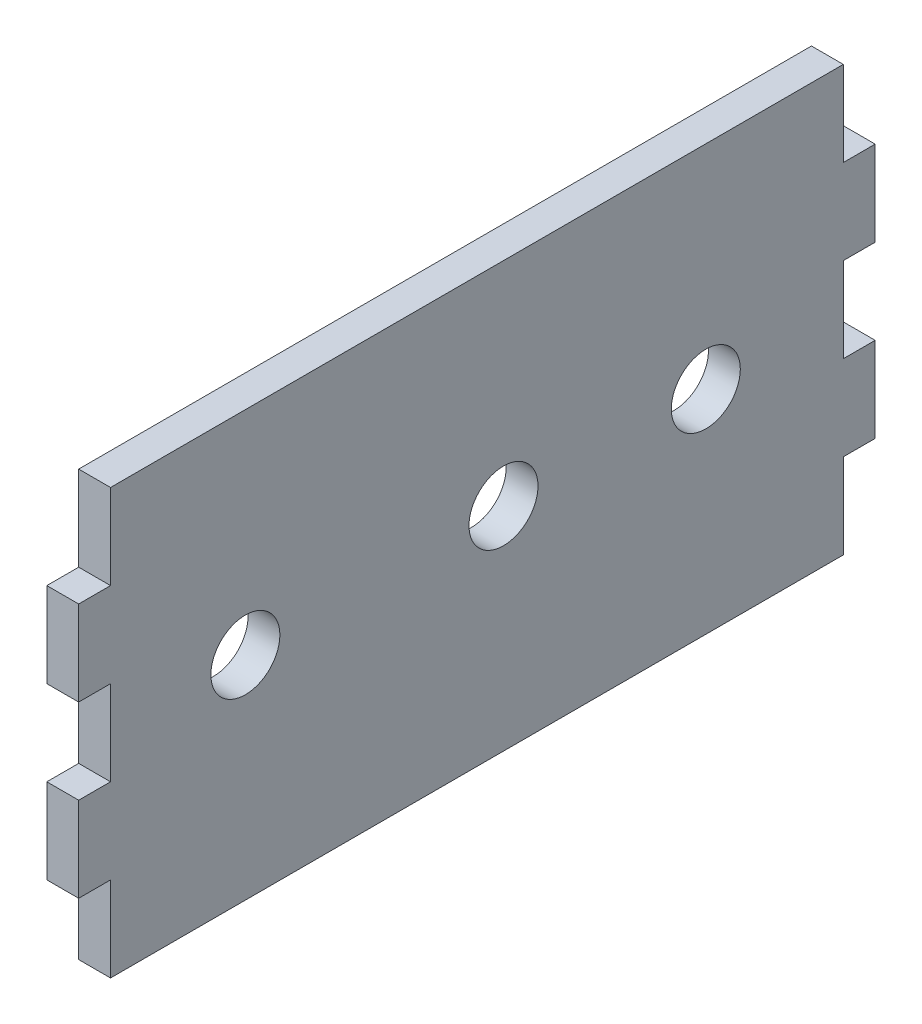
ISO-10303-21;
HEADER;
FILE_DESCRIPTION(('STEP AP214'),'2;1');
FILE_NAME('part.step','',(''),(''),'','','');
FILE_SCHEMA(('AUTOMOTIVE_DESIGN { 1 0 10303 214 1 1 1 1 }'));
ENDSEC;
DATA;
#1=APPLICATION_CONTEXT('core data for automotive mechanical design processes');
#2=APPLICATION_PROTOCOL_DEFINITION('international standard','automotive_design',2000,#1);
#3=PRODUCT_CONTEXT('',#1,'mechanical');
#4=PRODUCT('Part','Part','',(#3));
#5=PRODUCT_RELATED_PRODUCT_CATEGORY('part','',(#4));
#6=PRODUCT_DEFINITION_FORMATION('','',#4);
#7=PRODUCT_DEFINITION_CONTEXT('part definition',#1,'design');
#8=PRODUCT_DEFINITION('design','',#6,#7);
#9=PRODUCT_DEFINITION_SHAPE('','',#8);
#10=(LENGTH_UNIT() NAMED_UNIT(*) SI_UNIT(.MILLI.,.METRE.));
#11=(NAMED_UNIT(*) PLANE_ANGLE_UNIT() SI_UNIT($,.RADIAN.));
#12=(NAMED_UNIT(*) SI_UNIT($,.STERADIAN.) SOLID_ANGLE_UNIT());
#13=UNCERTAINTY_MEASURE_WITH_UNIT(LENGTH_MEASURE(1.E-05),#10,'distance_accuracy_value','');
#14=(GEOMETRIC_REPRESENTATION_CONTEXT(3) GLOBAL_UNCERTAINTY_ASSIGNED_CONTEXT((#13)) GLOBAL_UNIT_ASSIGNED_CONTEXT((#10,
#11,#12)) REPRESENTATION_CONTEXT('',''));
#15=CARTESIAN_POINT('',(0.,0.,0.));
#16=DIRECTION('',(0.,0.,1.));
#17=DIRECTION('',(1.,0.,0.));
#18=AXIS2_PLACEMENT_3D('',#15,#16,#17);
#19=CARTESIAN_POINT('',(6.,-40.0000000000001,75.));
#20=DIRECTION('',(0.,0.,-1.));
#21=DIRECTION('',(-1.,0.,0.));
#22=AXIS2_PLACEMENT_3D('',#19,#20,#21);
#23=PLANE('',#22);
#24=DIRECTION('',(0.,-1.,0.));
#25=VECTOR('',#24,1.);
#26=CARTESIAN_POINT('',(0.,-40.0000000000001,75.));
#27=LINE('',#26,#25);
#28=CARTESIAN_POINT('',(0.,23.9999999999999,75.));
#29=VERTEX_POINT('',#28);
#30=CARTESIAN_POINT('',(0.,7.99999999999999,75.));
#31=VERTEX_POINT('',#30);
#32=EDGE_CURVE('E205',#29,#31,#27,.T.);
#33=ORIENTED_EDGE('',*,*,#32,.T.);
#34=DIRECTION('',(1.,0.,0.));
#35=VECTOR('',#34,1.);
#36=CARTESIAN_POINT('',(0.,7.99999999999999,75.));
#37=LINE('',#36,#35);
#38=CARTESIAN_POINT('',(6.,7.99999999999999,75.));
#39=VERTEX_POINT('',#38);
#40=EDGE_CURVE('E263',#31,#39,#37,.T.);
#41=ORIENTED_EDGE('',*,*,#40,.T.);
#42=DIRECTION('',(0.,-1.,0.));
#43=VECTOR('',#42,1.);
#44=CARTESIAN_POINT('',(6.,-40.0000000000001,75.));
#45=LINE('',#44,#43);
#46=CARTESIAN_POINT('',(6.,23.9999999999999,75.));
#47=VERTEX_POINT('',#46);
#48=EDGE_CURVE('E216',#47,#39,#45,.T.);
#49=ORIENTED_EDGE('',*,*,#48,.F.);
#50=DIRECTION('',(1.,0.,0.));
#51=VECTOR('',#50,1.);
#52=CARTESIAN_POINT('',(0.,23.9999999999999,75.));
#53=LINE('',#52,#51);
#54=EDGE_CURVE('E238',#29,#47,#53,.T.);
#55=ORIENTED_EDGE('',*,*,#54,.F.);
#56=EDGE_LOOP('',(#33,#41,#49,#55));
#57=FACE_BOUND('',#56,.T.);
#58=ADVANCED_FACE('F34',(#57),#23,.F.);
#59=CARTESIAN_POINT('',(6.,-40.,-75.));
#60=DIRECTION('',(0.,0.,1.));
#61=DIRECTION('',(0.,-1.,0.));
#62=AXIS2_PLACEMENT_3D('',#59,#60,#61);
#63=PLANE('',#62);
#64=DIRECTION('',(0.,1.,0.));
#65=VECTOR('',#64,1.);
#66=CARTESIAN_POINT('',(6.,-40.,-75.));
#67=LINE('',#66,#65);
#68=CARTESIAN_POINT('',(6.,-24.,-75.));
#69=VERTEX_POINT('',#68);
#70=CARTESIAN_POINT('',(6.,-7.99999999999998,-75.));
#71=VERTEX_POINT('',#70);
#72=EDGE_CURVE('E43',#69,#71,#67,.T.);
#73=ORIENTED_EDGE('',*,*,#72,.F.);
#74=DIRECTION('',(1.,0.,0.));
#75=VECTOR('',#74,1.);
#76=CARTESIAN_POINT('',(0.,-24.,-75.));
#77=LINE('',#76,#75);
#78=CARTESIAN_POINT('',(0.,-24.,-75.));
#79=VERTEX_POINT('',#78);
#80=EDGE_CURVE('E298',#79,#69,#77,.T.);
#81=ORIENTED_EDGE('',*,*,#80,.F.);
#82=DIRECTION('',(0.,1.,0.));
#83=VECTOR('',#82,1.);
#84=CARTESIAN_POINT('',(0.,-40.,-75.));
#85=LINE('',#84,#83);
#86=CARTESIAN_POINT('',(0.,-7.99999999999998,-75.));
#87=VERTEX_POINT('',#86);
#88=EDGE_CURVE('E201',#79,#87,#85,.T.);
#89=ORIENTED_EDGE('',*,*,#88,.T.);
#90=DIRECTION('',(1.,0.,0.));
#91=VECTOR('',#90,1.);
#92=CARTESIAN_POINT('',(0.,-7.99999999999998,-75.));
#93=LINE('',#92,#91);
#94=EDGE_CURVE('E276',#87,#71,#93,.T.);
#95=ORIENTED_EDGE('',*,*,#94,.T.);
#96=EDGE_LOOP('',(#73,#81,#89,#95));
#97=FACE_BOUND('',#96,.T.);
#98=ADVANCED_FACE('F351',(#97),#63,.F.);
#99=CARTESIAN_POINT('',(0.,-8.00000000000001,75.));
#100=VERTEX_POINT('',#99);
#101=CARTESIAN_POINT('',(0.,-24.0000000000001,74.9999999999999));
#102=VERTEX_POINT('',#101);
#103=EDGE_CURVE('E208',#100,#102,#27,.T.);
#104=ORIENTED_EDGE('',*,*,#103,.T.);
#105=DIRECTION('',(1.,0.,0.));
#106=VECTOR('',#105,1.);
#107=CARTESIAN_POINT('',(0.,-24.0000000000001,74.9999999999999));
#108=LINE('',#107,#106);
#109=CARTESIAN_POINT('',(6.,-24.0000000000001,74.9999999999999));
#110=VERTEX_POINT('',#109);
#111=EDGE_CURVE('E251',#102,#110,#108,.T.);
#112=ORIENTED_EDGE('',*,*,#111,.T.);
#113=CARTESIAN_POINT('',(6.,-8.00000000000001,75.));
#114=VERTEX_POINT('',#113);
#115=EDGE_CURVE('E217',#114,#110,#45,.T.);
#116=ORIENTED_EDGE('',*,*,#115,.F.);
#117=DIRECTION('',(1.,0.,0.));
#118=VECTOR('',#117,1.);
#119=CARTESIAN_POINT('',(0.,-8.00000000000001,75.));
#120=LINE('',#119,#118);
#121=EDGE_CURVE('E256',#100,#114,#120,.T.);
#122=ORIENTED_EDGE('',*,*,#121,.F.);
#123=EDGE_LOOP('',(#104,#112,#116,#122));
#124=FACE_BOUND('',#123,.T.);
#125=ADVANCED_FACE('F36',(#124),#23,.F.);
#126=CARTESIAN_POINT('',(6.,-40.,-75.));
#127=DIRECTION('',(0.,1.,0.));
#128=DIRECTION('',(0.,0.,1.));
#129=AXIS2_PLACEMENT_3D('',#126,#127,#128);
#130=PLANE('',#129);
#131=DIRECTION('',(0.,0.,-1.));
#132=VECTOR('',#131,1.);
#133=CARTESIAN_POINT('',(6.,-40.,-75.));
#134=LINE('',#133,#132);
#135=CARTESIAN_POINT('',(6.,-40.0000000000001,68.9999999999999));
#136=VERTEX_POINT('',#135);
#137=CARTESIAN_POINT('',(6.,-40.,-68.9999999999999));
#138=VERTEX_POINT('',#137);
#139=EDGE_CURVE('E213',#136,#138,#134,.T.);
#140=ORIENTED_EDGE('',*,*,#139,.F.);
#141=DIRECTION('',(1.,0.,0.));
#142=VECTOR('',#141,1.);
#143=CARTESIAN_POINT('',(0.,-40.0000000000001,68.9999999999999));
#144=LINE('',#143,#142);
#145=CARTESIAN_POINT('',(0.,-40.0000000000001,68.9999999999999));
#146=VERTEX_POINT('',#145);
#147=EDGE_CURVE('E314',#146,#136,#144,.T.);
#148=ORIENTED_EDGE('',*,*,#147,.F.);
#149=DIRECTION('',(0.,0.,-1.));
#150=VECTOR('',#149,1.);
#151=CARTESIAN_POINT('',(0.,-40.,-75.));
#152=LINE('',#151,#150);
#153=CARTESIAN_POINT('',(0.,-40.,-68.9999999999999));
#154=VERTEX_POINT('',#153);
#155=EDGE_CURVE('E202',#146,#154,#152,.T.);
#156=ORIENTED_EDGE('',*,*,#155,.T.);
#157=DIRECTION('',(1.,0.,0.));
#158=VECTOR('',#157,1.);
#159=CARTESIAN_POINT('',(0.,-40.,-68.9999999999999));
#160=LINE('',#159,#158);
#161=EDGE_CURVE('E302',#154,#138,#160,.T.);
#162=ORIENTED_EDGE('',*,*,#161,.T.);
#163=EDGE_LOOP('',(#140,#148,#156,#162));
#164=FACE_BOUND('',#163,.T.);
#165=ADVANCED_FACE('F365',(#164),#130,.F.);
#166=CARTESIAN_POINT('',(0.,8.00000000000002,-75.));
#167=VERTEX_POINT('',#166);
#168=CARTESIAN_POINT('',(0.,24.,-75.));
#169=VERTEX_POINT('',#168);
#170=EDGE_CURVE('E191',#167,#169,#85,.T.);
#171=ORIENTED_EDGE('',*,*,#170,.T.);
#172=DIRECTION('',(1.,0.,0.));
#173=VECTOR('',#172,1.);
#174=CARTESIAN_POINT('',(0.,24.,-75.));
#175=LINE('',#174,#173);
#176=CARTESIAN_POINT('',(6.,24.,-75.));
#177=VERTEX_POINT('',#176);
#178=EDGE_CURVE('E288',#169,#177,#175,.T.);
#179=ORIENTED_EDGE('',*,*,#178,.T.);
#180=CARTESIAN_POINT('',(6.,8.00000000000002,-75.));
#181=VERTEX_POINT('',#180);
#182=EDGE_CURVE('E193',#181,#177,#67,.T.);
#183=ORIENTED_EDGE('',*,*,#182,.F.);
#184=DIRECTION('',(1.,0.,0.));
#185=VECTOR('',#184,1.);
#186=CARTESIAN_POINT('',(0.,8.00000000000002,-75.));
#187=LINE('',#186,#185);
#188=EDGE_CURVE('E177',#167,#181,#187,.T.);
#189=ORIENTED_EDGE('',*,*,#188,.F.);
#190=EDGE_LOOP('',(#171,#179,#183,#189));
#191=FACE_BOUND('',#190,.T.);
#192=ADVANCED_FACE('F189',(#191),#63,.F.);
#193=CARTESIAN_POINT('',(6.,39.9999999999999,-75.));
#194=DIRECTION('',(0.,-1.,0.));
#195=DIRECTION('',(0.,0.,-1.));
#196=AXIS2_PLACEMENT_3D('',#193,#194,#195);
#197=PLANE('',#196);
#198=DIRECTION('',(0.,0.,1.));
#199=VECTOR('',#198,1.);
#200=CARTESIAN_POINT('',(6.,39.9999999999999,-75.));
#201=LINE('',#200,#199);
#202=CARTESIAN_POINT('',(6.,40.,-69.));
#203=VERTEX_POINT('',#202);
#204=CARTESIAN_POINT('',(6.,39.9999999999999,69.));
#205=VERTEX_POINT('',#204);
#206=EDGE_CURVE('E11',#203,#205,#201,.T.);
#207=ORIENTED_EDGE('',*,*,#206,.F.);
#208=DIRECTION('',(1.,0.,0.));
#209=VECTOR('',#208,1.);
#210=CARTESIAN_POINT('',(0.,40.,-69.));
#211=LINE('',#210,#209);
#212=CARTESIAN_POINT('',(0.,40.,-69.));
#213=VERTEX_POINT('',#212);
#214=EDGE_CURVE('E284',#213,#203,#211,.T.);
#215=ORIENTED_EDGE('',*,*,#214,.F.);
#216=DIRECTION('',(0.,0.,1.));
#217=VECTOR('',#216,1.);
#218=CARTESIAN_POINT('',(0.,39.9999999999999,-75.));
#219=LINE('',#218,#217);
#220=CARTESIAN_POINT('',(0.,39.9999999999999,69.));
#221=VERTEX_POINT('',#220);
#222=EDGE_CURVE('E38',#213,#221,#219,.T.);
#223=ORIENTED_EDGE('',*,*,#222,.T.);
#224=DIRECTION('',(1.,0.,0.));
#225=VECTOR('',#224,1.);
#226=CARTESIAN_POINT('',(0.,39.9999999999999,69.));
#227=LINE('',#226,#225);
#228=EDGE_CURVE('E224',#221,#205,#227,.T.);
#229=ORIENTED_EDGE('',*,*,#228,.T.);
#230=EDGE_LOOP('',(#207,#215,#223,#229));
#231=FACE_BOUND('',#230,.T.);
#232=ADVANCED_FACE('F402',(#231),#197,.F.);
#233=CARTESIAN_POINT('',(6.,0.,0.));
#234=DIRECTION('',(1.,0.,0.));
#235=DIRECTION('',(0.,0.,-1.));
#236=AXIS2_PLACEMENT_3D('',#233,#234,#235);
#237=PLANE('',#236);
#238=DIRECTION('',(0.,0.,1.));
#239=VECTOR('',#238,1.);
#240=CARTESIAN_POINT('',(6.,-24.0000000000001,74.9999999999999));
#241=LINE('',#240,#239);
#242=CARTESIAN_POINT('',(6.,-24.0000000000001,68.9999999999999));
#243=VERTEX_POINT('',#242);
#244=EDGE_CURVE('E320',#243,#110,#241,.T.);
#245=ORIENTED_EDGE('',*,*,#244,.F.);
#246=DIRECTION('',(0.,1.,0.));
#247=VECTOR('',#246,1.);
#248=CARTESIAN_POINT('',(6.,-40.0000000000001,68.9999999999999));
#249=LINE('',#248,#247);
#250=EDGE_CURVE('E305',#136,#243,#249,.T.);
#251=ORIENTED_EDGE('',*,*,#250,.F.);
#252=ORIENTED_EDGE('',*,*,#139,.T.);
#253=DIRECTION('',(0.,-1.,0.));
#254=VECTOR('',#253,1.);
#255=CARTESIAN_POINT('',(6.,-40.,-68.9999999999999));
#256=LINE('',#255,#254);
#257=CARTESIAN_POINT('',(6.,-24.,-69.));
#258=VERTEX_POINT('',#257);
#259=EDGE_CURVE('E306',#258,#138,#256,.T.);
#260=ORIENTED_EDGE('',*,*,#259,.F.);
#261=DIRECTION('',(0.,0.,1.));
#262=VECTOR('',#261,1.);
#263=CARTESIAN_POINT('',(6.,-24.,-75.));
#264=LINE('',#263,#262);
#265=EDGE_CURVE('E290',#69,#258,#264,.T.);
#266=ORIENTED_EDGE('',*,*,#265,.F.);
#267=ORIENTED_EDGE('',*,*,#72,.T.);
#268=DIRECTION('',(0.,0.,-1.));
#269=VECTOR('',#268,1.);
#270=CARTESIAN_POINT('',(6.,-7.99999999999998,-75.));
#271=LINE('',#270,#269);
#272=CARTESIAN_POINT('',(6.,-7.99999999999998,-69.));
#273=VERTEX_POINT('',#272);
#274=EDGE_CURVE('E184',#273,#71,#271,.T.);
#275=ORIENTED_EDGE('',*,*,#274,.F.);
#276=DIRECTION('',(0.,-1.,0.));
#277=VECTOR('',#276,1.);
#278=CARTESIAN_POINT('',(6.,8.00000000000002,-68.9999999999999));
#279=LINE('',#278,#277);
#280=CARTESIAN_POINT('',(6.,8.00000000000002,-68.9999999999999));
#281=VERTEX_POINT('',#280);
#282=EDGE_CURVE('E333',#281,#273,#279,.T.);
#283=ORIENTED_EDGE('',*,*,#282,.F.);
#284=DIRECTION('',(0.,0.,1.));
#285=VECTOR('',#284,1.);
#286=CARTESIAN_POINT('',(6.,8.00000000000002,-75.));
#287=LINE('',#286,#285);
#288=EDGE_CURVE('E336',#181,#281,#287,.T.);
#289=ORIENTED_EDGE('',*,*,#288,.F.);
#290=ORIENTED_EDGE('',*,*,#182,.T.);
#291=DIRECTION('',(0.,0.,-1.));
#292=VECTOR('',#291,1.);
#293=CARTESIAN_POINT('',(6.,24.,-75.));
#294=LINE('',#293,#292);
#295=CARTESIAN_POINT('',(6.,24.,-69.));
#296=VERTEX_POINT('',#295);
#297=EDGE_CURVE('E291',#296,#177,#294,.T.);
#298=ORIENTED_EDGE('',*,*,#297,.F.);
#299=DIRECTION('',(0.,-1.,0.));
#300=VECTOR('',#299,1.);
#301=CARTESIAN_POINT('',(6.,40.,-69.));
#302=LINE('',#301,#300);
#303=EDGE_CURVE('E266',#203,#296,#302,.T.);
#304=ORIENTED_EDGE('',*,*,#303,.F.);
#305=ORIENTED_EDGE('',*,*,#206,.T.);
#306=DIRECTION('',(0.,1.,0.));
#307=VECTOR('',#306,1.);
#308=CARTESIAN_POINT('',(6.,39.9999999999999,69.));
#309=LINE('',#308,#307);
#310=CARTESIAN_POINT('',(6.,23.9999999999999,69.));
#311=VERTEX_POINT('',#310);
#312=EDGE_CURVE('E245',#311,#205,#309,.T.);
#313=ORIENTED_EDGE('',*,*,#312,.F.);
#314=DIRECTION('',(0.,0.,-1.));
#315=VECTOR('',#314,1.);
#316=CARTESIAN_POINT('',(6.,23.9999999999999,75.));
#317=LINE('',#316,#315);
#318=EDGE_CURVE('E248',#47,#311,#317,.T.);
#319=ORIENTED_EDGE('',*,*,#318,.F.);
#320=ORIENTED_EDGE('',*,*,#48,.T.);
#321=DIRECTION('',(0.,0.,1.));
#322=VECTOR('',#321,1.);
#323=CARTESIAN_POINT('',(6.,7.99999999999999,75.));
#324=LINE('',#323,#322);
#325=CARTESIAN_POINT('',(6.,7.99999999999999,68.9999999999999));
#326=VERTEX_POINT('',#325);
#327=EDGE_CURVE('E267',#326,#39,#324,.T.);
#328=ORIENTED_EDGE('',*,*,#327,.F.);
#329=DIRECTION('',(0.,1.,0.));
#330=VECTOR('',#329,1.);
#331=CARTESIAN_POINT('',(6.,7.99999999999999,68.9999999999999));
#332=LINE('',#331,#330);
#333=CARTESIAN_POINT('',(6.,-8.00000000000001,68.9999999999999));
#334=VERTEX_POINT('',#333);
#335=EDGE_CURVE('E270',#334,#326,#332,.T.);
#336=ORIENTED_EDGE('',*,*,#335,.F.);
#337=DIRECTION('',(0.,0.,-1.));
#338=VECTOR('',#337,1.);
#339=CARTESIAN_POINT('',(6.,-8.00000000000001,75.));
#340=LINE('',#339,#338);
#341=EDGE_CURVE('E273',#114,#334,#340,.T.);
#342=ORIENTED_EDGE('',*,*,#341,.F.);
#343=ORIENTED_EDGE('',*,*,#115,.T.);
#344=EDGE_LOOP('',(#245,#251,#252,#260,#266,#267,#275,#283,#289,#290,#298,#304,#305,#313,#319,
#320,#328,#336,#342,#343));
#345=FACE_BOUND('',#344,.T.);
#346=CARTESIAN_POINT('',(6.,0.,43.61));
#347=DIRECTION('',(1.,0.,0.));
#348=DIRECTION('',(0.,0.,-1.));
#349=AXIS2_PLACEMENT_3D('',#346,#347,#348);
#350=CIRCLE('',#349,6.5);
#351=CARTESIAN_POINT('',(6.,0.,37.11));
#352=VERTEX_POINT('',#351);
#353=EDGE_CURVE('E233',#352,#352,#350,.T.);
#354=ORIENTED_EDGE('',*,*,#353,.F.);
#355=EDGE_LOOP('',(#354));
#356=FACE_BOUND('',#355,.T.);
#357=CARTESIAN_POINT('',(6.,0.,-5.));
#358=DIRECTION('',(1.,0.,0.));
#359=DIRECTION('',(0.,0.,-1.));
#360=AXIS2_PLACEMENT_3D('',#357,#358,#359);
#361=CIRCLE('',#360,6.5);
#362=CARTESIAN_POINT('',(6.,0.,-11.5));
#363=VERTEX_POINT('',#362);
#364=EDGE_CURVE('E227',#363,#363,#361,.T.);
#365=ORIENTED_EDGE('',*,*,#364,.F.);
#366=EDGE_LOOP('',(#365));
#367=FACE_BOUND('',#366,.T.);
#368=CARTESIAN_POINT('',(6.,0.,-43.1));
#369=DIRECTION('',(1.,0.,0.));
#370=DIRECTION('',(0.,0.,-1.));
#371=AXIS2_PLACEMENT_3D('',#368,#369,#370);
#372=CIRCLE('',#371,6.5);
#373=CARTESIAN_POINT('',(6.,0.,-49.6));
#374=VERTEX_POINT('',#373);
#375=EDGE_CURVE('E220',#374,#374,#372,.T.);
#376=ORIENTED_EDGE('',*,*,#375,.F.);
#377=EDGE_LOOP('',(#376));
#378=FACE_BOUND('',#377,.T.);
#379=ADVANCED_FACE('F356',(#345,#356,#367,#378),#237,.T.);
#380=CARTESIAN_POINT('',(0.,0.,0.));
#381=DIRECTION('',(1.,0.,0.));
#382=DIRECTION('',(0.,0.,-1.));
#383=AXIS2_PLACEMENT_3D('',#380,#381,#382);
#384=PLANE('',#383);
#385=CARTESIAN_POINT('',(0.,0.,43.61));
#386=DIRECTION('',(1.,0.,0.));
#387=DIRECTION('',(0.,0.,-1.));
#388=AXIS2_PLACEMENT_3D('',#385,#386,#387);
#389=CIRCLE('',#388,6.5);
#390=CARTESIAN_POINT('',(0.,0.,37.11));
#391=VERTEX_POINT('',#390);
#392=EDGE_CURVE('E210',#391,#391,#389,.T.);
#393=ORIENTED_EDGE('',*,*,#392,.T.);
#394=EDGE_LOOP('',(#393));
#395=FACE_BOUND('',#394,.T.);
#396=CARTESIAN_POINT('',(0.,0.,-5.));
#397=DIRECTION('',(1.,0.,0.));
#398=DIRECTION('',(0.,0.,-1.));
#399=AXIS2_PLACEMENT_3D('',#396,#397,#398);
#400=CIRCLE('',#399,6.5);
#401=CARTESIAN_POINT('',(0.,0.,-11.5));
#402=VERTEX_POINT('',#401);
#403=EDGE_CURVE('E230',#402,#402,#400,.T.);
#404=ORIENTED_EDGE('',*,*,#403,.T.);
#405=EDGE_LOOP('',(#404));
#406=FACE_BOUND('',#405,.T.);
#407=CARTESIAN_POINT('',(0.,0.,-43.1));
#408=DIRECTION('',(1.,0.,0.));
#409=DIRECTION('',(0.,0.,-1.));
#410=AXIS2_PLACEMENT_3D('',#407,#408,#409);
#411=CIRCLE('',#410,6.5);
#412=CARTESIAN_POINT('',(0.,0.,-49.6));
#413=VERTEX_POINT('',#412);
#414=EDGE_CURVE('E223',#413,#413,#411,.T.);
#415=ORIENTED_EDGE('',*,*,#414,.T.);
#416=EDGE_LOOP('',(#415));
#417=FACE_BOUND('',#416,.T.);
#418=DIRECTION('',(0.,1.,0.));
#419=VECTOR('',#418,1.);
#420=CARTESIAN_POINT('',(0.,-40.0000000000001,68.9999999999999));
#421=LINE('',#420,#419);
#422=CARTESIAN_POINT('',(0.,-24.0000000000001,68.9999999999999));
#423=VERTEX_POINT('',#422);
#424=EDGE_CURVE('E322',#146,#423,#421,.T.);
#425=ORIENTED_EDGE('',*,*,#424,.T.);
#426=DIRECTION('',(0.,0.,1.));
#427=VECTOR('',#426,1.);
#428=CARTESIAN_POINT('',(0.,-24.0000000000001,74.9999999999999));
#429=LINE('',#428,#427);
#430=EDGE_CURVE('E51',#423,#102,#429,.T.);
#431=ORIENTED_EDGE('',*,*,#430,.T.);
#432=ORIENTED_EDGE('',*,*,#103,.F.);
#433=DIRECTION('',(0.,0.,-1.));
#434=VECTOR('',#433,1.);
#435=CARTESIAN_POINT('',(0.,-8.00000000000001,75.));
#436=LINE('',#435,#434);
#437=CARTESIAN_POINT('',(0.,-8.00000000000001,68.9999999999999));
#438=VERTEX_POINT('',#437);
#439=EDGE_CURVE('E269',#100,#438,#436,.T.);
#440=ORIENTED_EDGE('',*,*,#439,.T.);
#441=DIRECTION('',(0.,1.,0.));
#442=VECTOR('',#441,1.);
#443=CARTESIAN_POINT('',(0.,7.99999999999999,68.9999999999999));
#444=LINE('',#443,#442);
#445=CARTESIAN_POINT('',(0.,7.99999999999999,68.9999999999999));
#446=VERTEX_POINT('',#445);
#447=EDGE_CURVE('E279',#438,#446,#444,.T.);
#448=ORIENTED_EDGE('',*,*,#447,.T.);
#449=DIRECTION('',(0.,0.,1.));
#450=VECTOR('',#449,1.);
#451=CARTESIAN_POINT('',(0.,7.99999999999999,75.));
#452=LINE('',#451,#450);
#453=EDGE_CURVE('E259',#446,#31,#452,.T.);
#454=ORIENTED_EDGE('',*,*,#453,.T.);
#455=ORIENTED_EDGE('',*,*,#32,.F.);
#456=DIRECTION('',(0.,0.,-1.));
#457=VECTOR('',#456,1.);
#458=CARTESIAN_POINT('',(0.,23.9999999999999,75.));
#459=LINE('',#458,#457);
#460=CARTESIAN_POINT('',(0.,23.9999999999999,69.));
#461=VERTEX_POINT('',#460);
#462=EDGE_CURVE('E247',#29,#461,#459,.T.);
#463=ORIENTED_EDGE('',*,*,#462,.T.);
#464=DIRECTION('',(0.,1.,0.));
#465=VECTOR('',#464,1.);
#466=CARTESIAN_POINT('',(0.,39.9999999999999,69.));
#467=LINE('',#466,#465);
#468=EDGE_CURVE('E241',#461,#221,#467,.T.);
#469=ORIENTED_EDGE('',*,*,#468,.T.);
#470=ORIENTED_EDGE('',*,*,#222,.F.);
#471=DIRECTION('',(0.,-1.,0.));
#472=VECTOR('',#471,1.);
#473=CARTESIAN_POINT('',(0.,40.,-69.));
#474=LINE('',#473,#472);
#475=CARTESIAN_POINT('',(0.,24.,-69.));
#476=VERTEX_POINT('',#475);
#477=EDGE_CURVE('E293',#213,#476,#474,.T.);
#478=ORIENTED_EDGE('',*,*,#477,.T.);
#479=DIRECTION('',(0.,0.,-1.));
#480=VECTOR('',#479,1.);
#481=CARTESIAN_POINT('',(0.,24.,-75.));
#482=LINE('',#481,#480);
#483=EDGE_CURVE('E200',#476,#169,#482,.T.);
#484=ORIENTED_EDGE('',*,*,#483,.T.);
#485=ORIENTED_EDGE('',*,*,#170,.F.);
#486=DIRECTION('',(0.,0.,1.));
#487=VECTOR('',#486,1.);
#488=CARTESIAN_POINT('',(0.,8.00000000000002,-75.));
#489=LINE('',#488,#487);
#490=CARTESIAN_POINT('',(0.,8.00000000000002,-68.9999999999999));
#491=VERTEX_POINT('',#490);
#492=EDGE_CURVE('E173',#167,#491,#489,.T.);
#493=ORIENTED_EDGE('',*,*,#492,.T.);
#494=DIRECTION('',(0.,-1.,0.));
#495=VECTOR('',#494,1.);
#496=CARTESIAN_POINT('',(0.,8.00000000000002,-68.9999999999999));
#497=LINE('',#496,#495);
#498=CARTESIAN_POINT('',(0.,-7.99999999999998,-69.));
#499=VERTEX_POINT('',#498);
#500=EDGE_CURVE('E183',#491,#499,#497,.T.);
#501=ORIENTED_EDGE('',*,*,#500,.T.);
#502=DIRECTION('',(0.,0.,-1.));
#503=VECTOR('',#502,1.);
#504=CARTESIAN_POINT('',(0.,-7.99999999999998,-75.));
#505=LINE('',#504,#503);
#506=EDGE_CURVE('E194',#499,#87,#505,.T.);
#507=ORIENTED_EDGE('',*,*,#506,.T.);
#508=ORIENTED_EDGE('',*,*,#88,.F.);
#509=DIRECTION('',(0.,0.,1.));
#510=VECTOR('',#509,1.);
#511=CARTESIAN_POINT('',(0.,-24.,-75.));
#512=LINE('',#511,#510);
#513=CARTESIAN_POINT('',(0.,-24.,-69.));
#514=VERTEX_POINT('',#513);
#515=EDGE_CURVE('E308',#79,#514,#512,.T.);
#516=ORIENTED_EDGE('',*,*,#515,.T.);
#517=DIRECTION('',(0.,-1.,0.));
#518=VECTOR('',#517,1.);
#519=CARTESIAN_POINT('',(0.,-40.,-68.9999999999999));
#520=LINE('',#519,#518);
#521=EDGE_CURVE('E59',#514,#154,#520,.T.);
#522=ORIENTED_EDGE('',*,*,#521,.T.);
#523=ORIENTED_EDGE('',*,*,#155,.F.);
#524=EDGE_LOOP('',(#425,#431,#432,#440,#448,#454,#455,#463,#469,#470,#478,#484,#485,#493,#501,
#507,#508,#516,#522,#523));
#525=FACE_BOUND('',#524,.T.);
#526=ADVANCED_FACE('F198',(#395,#406,#417,#525),#384,.F.);
#527=CARTESIAN_POINT('',(0.,0.,-43.1));
#528=DIRECTION('',(1.,0.,0.));
#529=DIRECTION('',(0.,0.,-1.));
#530=AXIS2_PLACEMENT_3D('',#527,#528,#529);
#531=CYLINDRICAL_SURFACE('',#530,6.5);
#532=ORIENTED_EDGE('',*,*,#414,.F.);
#533=EDGE_LOOP('',(#532));
#534=FACE_BOUND('',#533,.T.);
#535=ORIENTED_EDGE('',*,*,#375,.T.);
#536=EDGE_LOOP('',(#535));
#537=FACE_BOUND('',#536,.T.);
#538=ADVANCED_FACE('F438',(#534,#537),#531,.F.);
#539=CARTESIAN_POINT('',(0.,0.,-5.));
#540=DIRECTION('',(1.,0.,0.));
#541=DIRECTION('',(0.,0.,-1.));
#542=AXIS2_PLACEMENT_3D('',#539,#540,#541);
#543=CYLINDRICAL_SURFACE('',#542,6.5);
#544=ORIENTED_EDGE('',*,*,#403,.F.);
#545=EDGE_LOOP('',(#544));
#546=FACE_BOUND('',#545,.T.);
#547=ORIENTED_EDGE('',*,*,#364,.T.);
#548=EDGE_LOOP('',(#547));
#549=FACE_BOUND('',#548,.T.);
#550=ADVANCED_FACE('F444',(#546,#549),#543,.F.);
#551=CARTESIAN_POINT('',(0.,0.,43.61));
#552=DIRECTION('',(1.,0.,0.));
#553=DIRECTION('',(0.,0.,-1.));
#554=AXIS2_PLACEMENT_3D('',#551,#552,#553);
#555=CYLINDRICAL_SURFACE('',#554,6.5);
#556=ORIENTED_EDGE('',*,*,#392,.F.);
#557=EDGE_LOOP('',(#556));
#558=FACE_BOUND('',#557,.T.);
#559=ORIENTED_EDGE('',*,*,#353,.T.);
#560=EDGE_LOOP('',(#559));
#561=FACE_BOUND('',#560,.T.);
#562=ADVANCED_FACE('F448',(#558,#561),#555,.F.);
#563=CARTESIAN_POINT('',(0.,39.9999999999999,69.));
#564=DIRECTION('',(0.,0.,-1.));
#565=DIRECTION('',(-1.,0.,0.));
#566=AXIS2_PLACEMENT_3D('',#563,#564,#565);
#567=PLANE('',#566);
#568=ORIENTED_EDGE('',*,*,#312,.T.);
#569=ORIENTED_EDGE('',*,*,#228,.F.);
#570=ORIENTED_EDGE('',*,*,#468,.F.);
#571=DIRECTION('',(1.,0.,0.));
#572=VECTOR('',#571,1.);
#573=CARTESIAN_POINT('',(0.,23.9999999999999,69.));
#574=LINE('',#573,#572);
#575=EDGE_CURVE('E240',#461,#311,#574,.T.);
#576=ORIENTED_EDGE('',*,*,#575,.T.);
#577=EDGE_LOOP('',(#568,#569,#570,#576));
#578=FACE_BOUND('',#577,.T.);
#579=ADVANCED_FACE('F399',(#578),#567,.F.);
#580=CARTESIAN_POINT('',(0.,23.9999999999999,75.));
#581=DIRECTION('',(0.,-1.,0.));
#582=DIRECTION('',(0.,0.,-1.));
#583=AXIS2_PLACEMENT_3D('',#580,#581,#582);
#584=PLANE('',#583);
#585=ORIENTED_EDGE('',*,*,#318,.T.);
#586=ORIENTED_EDGE('',*,*,#575,.F.);
#587=ORIENTED_EDGE('',*,*,#462,.F.);
#588=ORIENTED_EDGE('',*,*,#54,.T.);
#589=EDGE_LOOP('',(#585,#586,#587,#588));
#590=FACE_BOUND('',#589,.T.);
#591=ADVANCED_FACE('F393',(#590),#584,.F.);
#592=CARTESIAN_POINT('',(0.,-7.99999999999998,-75.));
#593=DIRECTION('',(0.,-1.,0.));
#594=DIRECTION('',(0.,0.,-1.));
#595=AXIS2_PLACEMENT_3D('',#592,#593,#594);
#596=PLANE('',#595);
#597=ORIENTED_EDGE('',*,*,#274,.T.);
#598=ORIENTED_EDGE('',*,*,#94,.F.);
#599=ORIENTED_EDGE('',*,*,#506,.F.);
#600=DIRECTION('',(1.,0.,0.));
#601=VECTOR('',#600,1.);
#602=CARTESIAN_POINT('',(0.,-7.99999999999998,-69.));
#603=LINE('',#602,#601);
#604=EDGE_CURVE('E328',#499,#273,#603,.T.);
#605=ORIENTED_EDGE('',*,*,#604,.T.);
#606=EDGE_LOOP('',(#597,#598,#599,#605));
#607=FACE_BOUND('',#606,.T.);
#608=ADVANCED_FACE('F347',(#607),#596,.F.);
#609=CARTESIAN_POINT('',(0.,8.00000000000002,-68.9999999999999));
#610=DIRECTION('',(0.,0.,1.));
#611=DIRECTION('',(0.,-1.,0.));
#612=AXIS2_PLACEMENT_3D('',#609,#610,#611);
#613=PLANE('',#612);
#614=ORIENTED_EDGE('',*,*,#282,.T.);
#615=ORIENTED_EDGE('',*,*,#604,.F.);
#616=ORIENTED_EDGE('',*,*,#500,.F.);
#617=DIRECTION('',(1.,0.,0.));
#618=VECTOR('',#617,1.);
#619=CARTESIAN_POINT('',(0.,8.00000000000002,-68.9999999999999));
#620=LINE('',#619,#618);
#621=EDGE_CURVE('E179',#491,#281,#620,.T.);
#622=ORIENTED_EDGE('',*,*,#621,.T.);
#623=EDGE_LOOP('',(#614,#615,#616,#622));
#624=FACE_BOUND('',#623,.T.);
#625=ADVANCED_FACE('F343',(#624),#613,.F.);
#626=CARTESIAN_POINT('',(0.,8.00000000000002,-75.));
#627=DIRECTION('',(0.,1.,0.));
#628=DIRECTION('',(0.,0.,1.));
#629=AXIS2_PLACEMENT_3D('',#626,#627,#628);
#630=PLANE('',#629);
#631=ORIENTED_EDGE('',*,*,#288,.T.);
#632=ORIENTED_EDGE('',*,*,#621,.F.);
#633=ORIENTED_EDGE('',*,*,#492,.F.);
#634=ORIENTED_EDGE('',*,*,#188,.T.);
#635=EDGE_LOOP('',(#631,#632,#633,#634));
#636=FACE_BOUND('',#635,.T.);
#637=ADVANCED_FACE('F176',(#636),#630,.F.);
#638=CARTESIAN_POINT('',(0.,7.99999999999999,75.));
#639=DIRECTION('',(0.,1.,0.));
#640=DIRECTION('',(0.,0.,1.));
#641=AXIS2_PLACEMENT_3D('',#638,#639,#640);
#642=PLANE('',#641);
#643=ORIENTED_EDGE('',*,*,#327,.T.);
#644=ORIENTED_EDGE('',*,*,#40,.F.);
#645=ORIENTED_EDGE('',*,*,#453,.F.);
#646=DIRECTION('',(1.,0.,0.));
#647=VECTOR('',#646,1.);
#648=CARTESIAN_POINT('',(0.,7.99999999999999,68.9999999999999));
#649=LINE('',#648,#647);
#650=EDGE_CURVE('E261',#446,#326,#649,.T.);
#651=ORIENTED_EDGE('',*,*,#650,.T.);
#652=EDGE_LOOP('',(#643,#644,#645,#651));
#653=FACE_BOUND('',#652,.T.);
#654=ADVANCED_FACE('F384',(#653),#642,.F.);
#655=CARTESIAN_POINT('',(0.,7.99999999999999,68.9999999999999));
#656=DIRECTION('',(0.,0.,-1.));
#657=DIRECTION('',(-1.,0.,0.));
#658=AXIS2_PLACEMENT_3D('',#655,#656,#657);
#659=PLANE('',#658);
#660=ORIENTED_EDGE('',*,*,#335,.T.);
#661=ORIENTED_EDGE('',*,*,#650,.F.);
#662=ORIENTED_EDGE('',*,*,#447,.F.);
#663=DIRECTION('',(1.,0.,0.));
#664=VECTOR('',#663,1.);
#665=CARTESIAN_POINT('',(0.,-8.00000000000001,68.9999999999999));
#666=LINE('',#665,#664);
#667=EDGE_CURVE('E258',#438,#334,#666,.T.);
#668=ORIENTED_EDGE('',*,*,#667,.T.);
#669=EDGE_LOOP('',(#660,#661,#662,#668));
#670=FACE_BOUND('',#669,.T.);
#671=ADVANCED_FACE('F380',(#670),#659,.F.);
#672=CARTESIAN_POINT('',(0.,-8.00000000000001,75.));
#673=DIRECTION('',(0.,-1.,0.));
#674=DIRECTION('',(0.,0.,-1.));
#675=AXIS2_PLACEMENT_3D('',#672,#673,#674);
#676=PLANE('',#675);
#677=ORIENTED_EDGE('',*,*,#341,.T.);
#678=ORIENTED_EDGE('',*,*,#667,.F.);
#679=ORIENTED_EDGE('',*,*,#439,.F.);
#680=ORIENTED_EDGE('',*,*,#121,.T.);
#681=EDGE_LOOP('',(#677,#678,#679,#680));
#682=FACE_BOUND('',#681,.T.);
#683=ADVANCED_FACE('F377',(#682),#676,.F.);
#684=CARTESIAN_POINT('',(0.,24.,-75.));
#685=DIRECTION('',(0.,-1.,0.));
#686=DIRECTION('',(0.,0.,-1.));
#687=AXIS2_PLACEMENT_3D('',#684,#685,#686);
#688=PLANE('',#687);
#689=ORIENTED_EDGE('',*,*,#297,.T.);
#690=ORIENTED_EDGE('',*,*,#178,.F.);
#691=ORIENTED_EDGE('',*,*,#483,.F.);
#692=DIRECTION('',(1.,0.,0.));
#693=VECTOR('',#692,1.);
#694=CARTESIAN_POINT('',(0.,24.,-69.));
#695=LINE('',#694,#693);
#696=EDGE_CURVE('E286',#476,#296,#695,.T.);
#697=ORIENTED_EDGE('',*,*,#696,.T.);
#698=EDGE_LOOP('',(#689,#690,#691,#697));
#699=FACE_BOUND('',#698,.T.);
#700=ADVANCED_FACE('F410',(#699),#688,.F.);
#701=CARTESIAN_POINT('',(0.,40.,-69.));
#702=DIRECTION('',(0.,0.,1.));
#703=DIRECTION('',(1.,0.,0.));
#704=AXIS2_PLACEMENT_3D('',#701,#702,#703);
#705=PLANE('',#704);
#706=ORIENTED_EDGE('',*,*,#303,.T.);
#707=ORIENTED_EDGE('',*,*,#696,.F.);
#708=ORIENTED_EDGE('',*,*,#477,.F.);
#709=ORIENTED_EDGE('',*,*,#214,.T.);
#710=EDGE_LOOP('',(#706,#707,#708,#709));
#711=FACE_BOUND('',#710,.T.);
#712=ADVANCED_FACE('F407',(#711),#705,.F.);
#713=CARTESIAN_POINT('',(0.,-40.,-68.9999999999999));
#714=DIRECTION('',(0.,0.,1.));
#715=DIRECTION('',(0.,-1.,0.));
#716=AXIS2_PLACEMENT_3D('',#713,#714,#715);
#717=PLANE('',#716);
#718=ORIENTED_EDGE('',*,*,#259,.T.);
#719=ORIENTED_EDGE('',*,*,#161,.F.);
#720=ORIENTED_EDGE('',*,*,#521,.F.);
#721=DIRECTION('',(1.,0.,0.));
#722=VECTOR('',#721,1.);
#723=CARTESIAN_POINT('',(0.,-24.,-69.));
#724=LINE('',#723,#722);
#725=EDGE_CURVE('E300',#514,#258,#724,.T.);
#726=ORIENTED_EDGE('',*,*,#725,.T.);
#727=EDGE_LOOP('',(#718,#719,#720,#726));
#728=FACE_BOUND('',#727,.T.);
#729=ADVANCED_FACE('F417',(#728),#717,.F.);
#730=CARTESIAN_POINT('',(0.,-24.,-75.));
#731=DIRECTION('',(0.,1.,0.));
#732=DIRECTION('',(0.,0.,1.));
#733=AXIS2_PLACEMENT_3D('',#730,#731,#732);
#734=PLANE('',#733);
#735=ORIENTED_EDGE('',*,*,#265,.T.);
#736=ORIENTED_EDGE('',*,*,#725,.F.);
#737=ORIENTED_EDGE('',*,*,#515,.F.);
#738=ORIENTED_EDGE('',*,*,#80,.T.);
#739=EDGE_LOOP('',(#735,#736,#737,#738));
#740=FACE_BOUND('',#739,.T.);
#741=ADVANCED_FACE('F360',(#740),#734,.F.);
#742=CARTESIAN_POINT('',(0.,-24.0000000000001,74.9999999999999));
#743=DIRECTION('',(0.,1.,0.));
#744=DIRECTION('',(0.,0.,1.));
#745=AXIS2_PLACEMENT_3D('',#742,#743,#744);
#746=PLANE('',#745);
#747=ORIENTED_EDGE('',*,*,#244,.T.);
#748=ORIENTED_EDGE('',*,*,#111,.F.);
#749=ORIENTED_EDGE('',*,*,#430,.F.);
#750=DIRECTION('',(1.,0.,0.));
#751=VECTOR('',#750,1.);
#752=CARTESIAN_POINT('',(0.,-24.0000000000001,68.9999999999999));
#753=LINE('',#752,#751);
#754=EDGE_CURVE('E316',#423,#243,#753,.T.);
#755=ORIENTED_EDGE('',*,*,#754,.T.);
#756=EDGE_LOOP('',(#747,#748,#749,#755));
#757=FACE_BOUND('',#756,.T.);
#758=ADVANCED_FACE('F371',(#757),#746,.F.);
#759=CARTESIAN_POINT('',(0.,-40.0000000000001,68.9999999999999));
#760=DIRECTION('',(0.,0.,-1.));
#761=DIRECTION('',(0.,1.,0.));
#762=AXIS2_PLACEMENT_3D('',#759,#760,#761);
#763=PLANE('',#762);
#764=ORIENTED_EDGE('',*,*,#250,.T.);
#765=ORIENTED_EDGE('',*,*,#754,.F.);
#766=ORIENTED_EDGE('',*,*,#424,.F.);
#767=ORIENTED_EDGE('',*,*,#147,.T.);
#768=EDGE_LOOP('',(#764,#765,#766,#767));
#769=FACE_BOUND('',#768,.T.);
#770=ADVANCED_FACE('F368',(#769),#763,.F.);
#771=CLOSED_SHELL('',(#58,#98,#125,#165,#192,#232,#379,#526,#538,#550,#562,#579,#591,#608,#625,
#637,#654,#671,#683,#700,#712,#729,#741,#758,#770));
#772=MANIFOLD_SOLID_BREP('B2',#771);
#773=ADVANCED_BREP_SHAPE_REPRESENTATION('',(#18,#772),#14);
#774=SHAPE_DEFINITION_REPRESENTATION(#9,#773);
ENDSEC;
END-ISO-10303-21;
